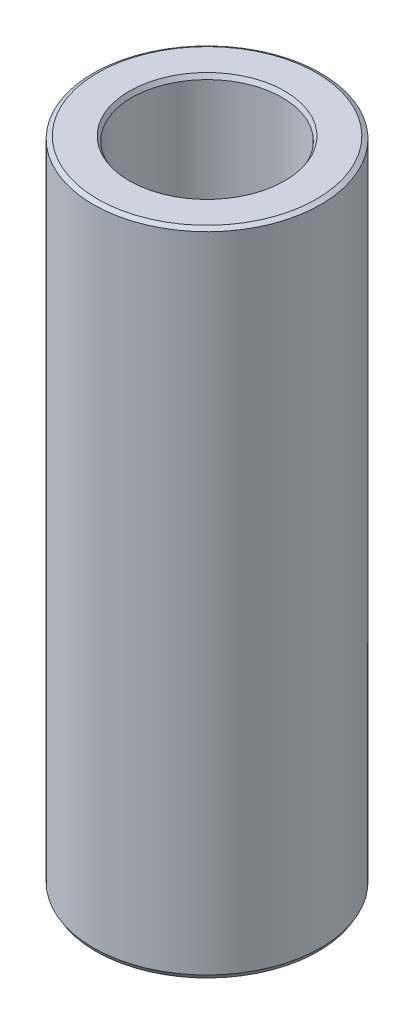
ISO-10303-21;
HEADER;
FILE_DESCRIPTION(('STEP AP214'),'2;1');
FILE_NAME('part.step','',(''),(''),'','','');
FILE_SCHEMA(('AUTOMOTIVE_DESIGN { 1 0 10303 214 1 1 1 1 }'));
ENDSEC;
DATA;
#1=APPLICATION_CONTEXT('core data for automotive mechanical design processes');
#2=APPLICATION_PROTOCOL_DEFINITION('international standard','automotive_design',2000,#1);
#3=PRODUCT_CONTEXT('',#1,'mechanical');
#4=PRODUCT('Part','Part','',(#3));
#5=PRODUCT_RELATED_PRODUCT_CATEGORY('part','',(#4));
#6=PRODUCT_DEFINITION_FORMATION('','',#4);
#7=PRODUCT_DEFINITION_CONTEXT('part definition',#1,'design');
#8=PRODUCT_DEFINITION('design','',#6,#7);
#9=PRODUCT_DEFINITION_SHAPE('','',#8);
#10=(LENGTH_UNIT() NAMED_UNIT(*) SI_UNIT(.MILLI.,.METRE.));
#11=(NAMED_UNIT(*) PLANE_ANGLE_UNIT() SI_UNIT($,.RADIAN.));
#12=(NAMED_UNIT(*) SI_UNIT($,.STERADIAN.) SOLID_ANGLE_UNIT());
#13=UNCERTAINTY_MEASURE_WITH_UNIT(LENGTH_MEASURE(1.E-05),#10,'distance_accuracy_value','');
#14=(GEOMETRIC_REPRESENTATION_CONTEXT(3) GLOBAL_UNCERTAINTY_ASSIGNED_CONTEXT((#13)) GLOBAL_UNIT_ASSIGNED_CONTEXT((#10,
#11,#12)) REPRESENTATION_CONTEXT('',''));
#15=CARTESIAN_POINT('',(0.,0.,0.));
#16=DIRECTION('',(0.,0.,1.));
#17=DIRECTION('',(1.,0.,0.));
#18=AXIS2_PLACEMENT_3D('',#15,#16,#17);
#19=CARTESIAN_POINT('',(0.,200.072638793867,0.));
#20=DIRECTION('',(0.,-1.,0.));
#21=DIRECTION('',(0.,0.,-1.));
#22=AXIS2_PLACEMENT_3D('',#19,#20,#21);
#23=CYLINDRICAL_SURFACE('',#22,35.);
#24=CARTESIAN_POINT('',(0.,1.3390491402287,0.));
#25=DIRECTION('',(0.,1.,0.));
#26=DIRECTION('',(0.,0.,1.));
#27=AXIS2_PLACEMENT_3D('',#24,#25,#26);
#28=CIRCLE('',#27,35.);
#29=CARTESIAN_POINT('',(0.,1.3390491402287,35.));
#30=VERTEX_POINT('',#29);
#31=EDGE_CURVE('E10',#30,#30,#28,.T.);
#32=ORIENTED_EDGE('',*,*,#31,.T.);
#33=EDGE_LOOP('',(#32));
#34=FACE_BOUND('',#33,.T.);
#35=CARTESIAN_POINT('',(0.,199.299538412298,0.));
#36=DIRECTION('',(0.,1.,0.));
#37=DIRECTION('',(0.,0.,1.));
#38=AXIS2_PLACEMENT_3D('',#35,#36,#37);
#39=CIRCLE('',#38,35.);
#40=CARTESIAN_POINT('',(0.,199.299538412298,35.));
#41=VERTEX_POINT('',#40);
#42=EDGE_CURVE('E50',#41,#41,#39,.F.);
#43=ORIENTED_EDGE('',*,*,#42,.T.);
#44=EDGE_LOOP('',(#43));
#45=FACE_BOUND('',#44,.T.);
#46=ADVANCED_FACE('F39',(#34,#45),#23,.T.);
#47=CARTESIAN_POINT('',(0.,200.072638793867,0.));
#48=DIRECTION('',(0.,1.,0.));
#49=DIRECTION('',(0.,0.,1.));
#50=AXIS2_PLACEMENT_3D('',#47,#48,#49);
#51=PLANE('',#50);
#52=CARTESIAN_POINT('',(0.,200.072638793867,0.));
#53=DIRECTION('',(0.,1.,0.));
#54=DIRECTION('',(0.,0.,1.));
#55=AXIS2_PLACEMENT_3D('',#52,#53,#54);
#56=CIRCLE('',#55,23.9135605204514);
#57=CARTESIAN_POINT('',(0.,200.072638793867,23.9135605204514));
#58=VERTEX_POINT('',#57);
#59=EDGE_CURVE('E58',#58,#58,#56,.F.);
#60=ORIENTED_EDGE('',*,*,#59,.T.);
#61=EDGE_LOOP('',(#60));
#62=FACE_BOUND('',#61,.T.);
#63=CARTESIAN_POINT('',(0.,200.072638793867,0.));
#64=DIRECTION('',(0.,1.,0.));
#65=DIRECTION('',(0.,0.,1.));
#66=AXIS2_PLACEMENT_3D('',#63,#64,#65);
#67=CIRCLE('',#66,33.6609508597713);
#68=CARTESIAN_POINT('',(0.,200.072638793867,33.6609508597713));
#69=VERTEX_POINT('',#68);
#70=EDGE_CURVE('E61',#69,#69,#67,.T.);
#71=ORIENTED_EDGE('',*,*,#70,.T.);
#72=EDGE_LOOP('',(#71));
#73=FACE_BOUND('',#72,.T.);
#74=ADVANCED_FACE('F88',(#62,#73),#51,.T.);
#75=CARTESIAN_POINT('',(0.,0.,0.));
#76=DIRECTION('',(0.,1.,0.));
#77=DIRECTION('',(0.,0.,1.));
#78=AXIS2_PLACEMENT_3D('',#75,#76,#77);
#79=PLANE('',#78);
#80=CARTESIAN_POINT('',(0.,0.,0.));
#81=DIRECTION('',(0.,1.,0.));
#82=DIRECTION('',(0.,0.,1.));
#83=AXIS2_PLACEMENT_3D('',#80,#81,#82);
#84=CIRCLE('',#83,24.4795092791109);
#85=CARTESIAN_POINT('',(0.,0.,24.4795092791109));
#86=VERTEX_POINT('',#85);
#87=EDGE_CURVE('E51',#86,#86,#84,.T.);
#88=ORIENTED_EDGE('',*,*,#87,.T.);
#89=EDGE_LOOP('',(#88));
#90=FACE_BOUND('',#89,.T.);
#91=CARTESIAN_POINT('',(0.,0.,0.));
#92=DIRECTION('',(0.,1.,0.));
#93=DIRECTION('',(0.,0.,1.));
#94=AXIS2_PLACEMENT_3D('',#91,#92,#93);
#95=CIRCLE('',#94,34.2268996184308);
#96=CARTESIAN_POINT('',(0.,0.,34.2268996184308));
#97=VERTEX_POINT('',#96);
#98=EDGE_CURVE('E54',#97,#97,#95,.F.);
#99=ORIENTED_EDGE('',*,*,#98,.T.);
#100=EDGE_LOOP('',(#99));
#101=FACE_BOUND('',#100,.T.);
#102=ADVANCED_FACE('F83',(#90,#101),#79,.F.);
#103=CARTESIAN_POINT('',(0.,200.072638793867,0.));
#104=DIRECTION('',(0.,-1.,0.));
#105=DIRECTION('',(0.,0.,-1.));
#106=AXIS2_PLACEMENT_3D('',#103,#104,#105);
#107=CYLINDRICAL_SURFACE('',#106,23.1404601388823);
#108=CARTESIAN_POINT('',(0.,198.733589653638,0.));
#109=DIRECTION('',(0.,1.,0.));
#110=DIRECTION('',(0.,0.,1.));
#111=AXIS2_PLACEMENT_3D('',#108,#109,#110);
#112=CIRCLE('',#111,23.1404601388823);
#113=CARTESIAN_POINT('',(0.,198.733589653638,23.1404601388823));
#114=VERTEX_POINT('',#113);
#115=EDGE_CURVE('E67',#114,#114,#112,.T.);
#116=ORIENTED_EDGE('',*,*,#115,.T.);
#117=EDGE_LOOP('',(#116));
#118=FACE_BOUND('',#117,.T.);
#119=CARTESIAN_POINT('',(0.,0.773100381569164,0.));
#120=DIRECTION('',(0.,1.,0.));
#121=DIRECTION('',(0.,0.,1.));
#122=AXIS2_PLACEMENT_3D('',#119,#120,#121);
#123=CIRCLE('',#122,23.1404601388823);
#124=CARTESIAN_POINT('',(0.,0.773100381569164,23.1404601388823));
#125=VERTEX_POINT('',#124);
#126=EDGE_CURVE('E69',#125,#125,#123,.F.);
#127=ORIENTED_EDGE('',*,*,#126,.T.);
#128=EDGE_LOOP('',(#127));
#129=FACE_BOUND('',#128,.T.);
#130=ADVANCED_FACE('F71',(#118,#129),#107,.F.);
#131=CARTESIAN_POINT('',(0.,198.733589653638,0.));
#132=DIRECTION('',(0.,1.,0.));
#133=DIRECTION('',(0.,0.,1.));
#134=AXIS2_PLACEMENT_3D('',#131,#132,#133);
#135=CONICAL_SURFACE('',#134,23.1404601388823,0.523598775598291);
#136=ORIENTED_EDGE('',*,*,#59,.F.);
#137=EDGE_LOOP('',(#136));
#138=FACE_BOUND('',#137,.T.);
#139=ORIENTED_EDGE('',*,*,#115,.F.);
#140=EDGE_LOOP('',(#139));
#141=FACE_BOUND('',#140,.T.);
#142=ADVANCED_FACE('F77',(#138,#141),#135,.F.);
#143=CARTESIAN_POINT('',(0.,0.,0.));
#144=DIRECTION('',(0.,-1.,0.));
#145=DIRECTION('',(0.,0.,-1.));
#146=AXIS2_PLACEMENT_3D('',#143,#144,#145);
#147=CONICAL_SURFACE('',#146,24.4795092791109,1.04719755119659);
#148=ORIENTED_EDGE('',*,*,#126,.F.);
#149=EDGE_LOOP('',(#148));
#150=FACE_BOUND('',#149,.T.);
#151=ORIENTED_EDGE('',*,*,#87,.F.);
#152=EDGE_LOOP('',(#151));
#153=FACE_BOUND('',#152,.T.);
#154=ADVANCED_FACE('F73',(#150,#153),#147,.F.);
#155=CARTESIAN_POINT('',(0.,1.3390491402287,0.));
#156=DIRECTION('',(0.,1.,0.));
#157=DIRECTION('',(0.,0.,1.));
#158=AXIS2_PLACEMENT_3D('',#155,#156,#157);
#159=CONICAL_SURFACE('',#158,35.,0.523598775598304);
#160=CARTESIAN_POINT('',(0.,0.,34.2268996184308));
#161=CARTESIAN_POINT('',(0.,0.0139484285440487,34.2349527474055));
#162=CARTESIAN_POINT('',(0.,0.0278968570880977,34.2430058763802));
#163=CARTESIAN_POINT('',(0.,0.0557937141761956,34.2591121343295));
#164=CARTESIAN_POINT('',(0.,0.0697421427202445,34.2671652633042));
#165=CARTESIAN_POINT('',(0.,0.0976389998083424,34.2832715212536));
#166=CARTESIAN_POINT('',(0.,0.111587428352391,34.2913246502283));
#167=CARTESIAN_POINT('',(0.,0.139484285440489,34.3074309081776));
#168=CARTESIAN_POINT('',(0.,0.153432713984538,34.3154840371523));
#169=CARTESIAN_POINT('',(0.,0.181329571072636,34.3315902951017));
#170=CARTESIAN_POINT('',(0.,0.195277999616685,34.3396434240763));
#171=CARTESIAN_POINT('',(0.,0.223174856704783,34.3557496820257));
#172=CARTESIAN_POINT('',(0.,0.237123285248832,34.3638028110004));
#173=CARTESIAN_POINT('',(0.,0.26502014233693,34.3799090689497));
#174=CARTESIAN_POINT('',(0.,0.278968570880979,34.3879621979244));
#175=CARTESIAN_POINT('',(0.,0.306865427969077,34.4040684558738));
#176=CARTESIAN_POINT('',(0.,0.320813856513125,34.4121215848484));
#177=CARTESIAN_POINT('',(0.,0.348710713601223,34.4282278427978));
#178=CARTESIAN_POINT('',(0.,0.362659142145272,34.4362809717725));
#179=CARTESIAN_POINT('',(0.,0.39055599923337,34.4523872297218));
#180=CARTESIAN_POINT('',(0.,0.404504427777419,34.4604403586965));
#181=CARTESIAN_POINT('',(0.,0.432401284865517,34.4765466166459));
#182=CARTESIAN_POINT('',(0.,0.446349713409566,34.4845997456206));
#183=CARTESIAN_POINT('',(0.,0.474246570497664,34.5007060035699));
#184=CARTESIAN_POINT('',(0.,0.488194999041713,34.5087591325446));
#185=CARTESIAN_POINT('',(0.,0.516091856129811,34.524865390494));
#186=CARTESIAN_POINT('',(0.,0.53004028467386,34.5329185194686));
#187=CARTESIAN_POINT('',(0.,0.557937141761957,34.549024777418));
#188=CARTESIAN_POINT('',(0.,0.571885570306006,34.5570779063927));
#189=CARTESIAN_POINT('',(0.,0.599782427394104,34.573184164342));
#190=CARTESIAN_POINT('',(0.,0.613730855938154,34.5812372933167));
#191=CARTESIAN_POINT('',(0.,0.641627713026252,34.5973435512661));
#192=CARTESIAN_POINT('',(0.,0.6555761415703,34.6053966802407));
#193=CARTESIAN_POINT('',(0.,0.683472998658398,34.6215029381901));
#194=CARTESIAN_POINT('',(0.,0.697421427202447,34.6295560671648));
#195=CARTESIAN_POINT('',(0.,0.725318284290545,34.6456623251141));
#196=CARTESIAN_POINT('',(0.,0.739266712834594,34.6537154540888));
#197=CARTESIAN_POINT('',(0.,0.767163569922692,34.6698217120382));
#198=CARTESIAN_POINT('',(0.,0.781111998466741,34.6778748410128));
#199=CARTESIAN_POINT('',(0.,0.809008855554838,34.6939810989622));
#200=CARTESIAN_POINT('',(0.,0.822957284098887,34.7020342279369));
#201=CARTESIAN_POINT('',(0.,0.850854141186985,34.7181404858862));
#202=CARTESIAN_POINT('',(0.,0.864802569731034,34.7261936148609));
#203=CARTESIAN_POINT('',(0.,0.892699426819132,34.7422998728103));
#204=CARTESIAN_POINT('',(0.,0.906647855363181,34.750353001785));
#205=CARTESIAN_POINT('',(0.,0.934544712451279,34.7664592597343));
#206=CARTESIAN_POINT('',(0.,0.948493140995328,34.774512388709));
#207=CARTESIAN_POINT('',(0.,0.976389998083426,34.7906186466584));
#208=CARTESIAN_POINT('',(0.,0.990338426627475,34.798671775633));
#209=CARTESIAN_POINT('',(0.,1.01823528371557,34.8147780335824));
#210=CARTESIAN_POINT('',(0.,1.03218371225962,34.8228311625571));
#211=CARTESIAN_POINT('',(0.,1.06008056934772,34.8389374205064));
#212=CARTESIAN_POINT('',(0.,1.07402899789177,34.8469905494811));
#213=CARTESIAN_POINT('',(0.,1.10192585497987,34.8630968074305));
#214=CARTESIAN_POINT('',(0.,1.11587428352392,34.8711499364051));
#215=CARTESIAN_POINT('',(0.,1.14377114061201,34.8872561943545));
#216=CARTESIAN_POINT('',(0.,1.15771956915606,34.8953093233292));
#217=CARTESIAN_POINT('',(0.,1.18561642624416,34.9114155812785));
#218=CARTESIAN_POINT('',(0.,1.19956485478821,34.9194687102532));
#219=CARTESIAN_POINT('',(0.,1.22746171187631,34.9355749682026));
#220=CARTESIAN_POINT('',(0.,1.24141014042036,34.9436280971773));
#221=CARTESIAN_POINT('',(0.,1.26930699750845,34.9597343551266));
#222=CARTESIAN_POINT('',(0.,1.2832554260525,34.9677874841013));
#223=CARTESIAN_POINT('',(0.,1.3111522831406,34.9838937420507));
#224=CARTESIAN_POINT('',(0.,1.32510071168465,34.9919468710253));
#225=CARTESIAN_POINT('',(0.,1.3390491402287,35.));
#226=B_SPLINE_CURVE_WITH_KNOTS('',3,(#160,#161,#162,#163,#164,#165,#166,#167,#168,#169,#170,
#171,#172,#173,#174,#175,#176,#177,#178,#179,#180,#181,#182,#183,#184,#185,#186,#187,#188,#189,
#190,#191,#192,#193,#194,#195,#196,#197,#198,#199,#200,#201,#202,#203,#204,#205,#206,#207,#208,
#209,#210,#211,#212,#213,#214,#215,#216,#217,#218,#219,#220,#221,#222,#223,#224,#225),
.UNSPECIFIED.,.F.,.F.,(4,2,2,2,2,2,2,2,2,2,2,2,2,2,2,2,2,2,2,2,2,2,2,2,2,2,2,2,2,2,2,2,4),(0.,
0.0483187738480738,0.0966375476961475,0.144956321544221,0.193275095392295,0.241593869240369,
0.289912643088443,0.338231416936516,0.38655019078459,0.434868964632664,0.483187738480737,
0.531506512328811,0.579825286176885,0.628144060024959,0.676462833873032,0.724781607721103,
0.773100381569176,0.82141915541725,0.869737929265324,0.918056703113398,0.966375476961471,
1.01469425080955,1.06301302465762,1.11133179850569,1.15965057235377,1.20796934620184,
1.25628812004991,1.30460689389799,1.35292566774606,1.40124444159414,1.44956321544221,
1.49788198929028,1.54620076313836),.UNSPECIFIED.);
#227=EDGE_CURVE('BSEAM76',#97,#30,#226,.T.);
#228=ORIENTED_EDGE('',*,*,#98,.F.);
#229=ORIENTED_EDGE('',*,*,#31,.F.);
#230=ORIENTED_EDGE('',*,*,#227,.T.);
#231=ORIENTED_EDGE('',*,*,#227,.F.);
#232=EDGE_LOOP('',(#228,#230,#229,#231));
#233=FACE_BOUND('',#232,.T.);
#234=ADVANCED_FACE('F76',(#233),#159,.T.);
#235=CARTESIAN_POINT('',(0.,200.072638793867,0.));
#236=DIRECTION('',(0.,-1.,0.));
#237=DIRECTION('',(0.,0.,-1.));
#238=AXIS2_PLACEMENT_3D('',#235,#236,#237);
#239=CONICAL_SURFACE('',#238,33.6609508597713,1.0471975511966);
#240=ORIENTED_EDGE('',*,*,#42,.F.);
#241=EDGE_LOOP('',(#240));
#242=FACE_BOUND('',#241,.T.);
#243=ORIENTED_EDGE('',*,*,#70,.F.);
#244=EDGE_LOOP('',(#243));
#245=FACE_BOUND('',#244,.T.);
#246=ADVANCED_FACE('F45',(#242,#245),#239,.T.);
#247=CLOSED_SHELL('',(#46,#74,#102,#130,#142,#154,#234,#246));
#248=MANIFOLD_SOLID_BREP('B2',#247);
#249=ADVANCED_BREP_SHAPE_REPRESENTATION('',(#18,#248),#14);
#250=SHAPE_DEFINITION_REPRESENTATION(#9,#249);
ENDSEC;
END-ISO-10303-21;
